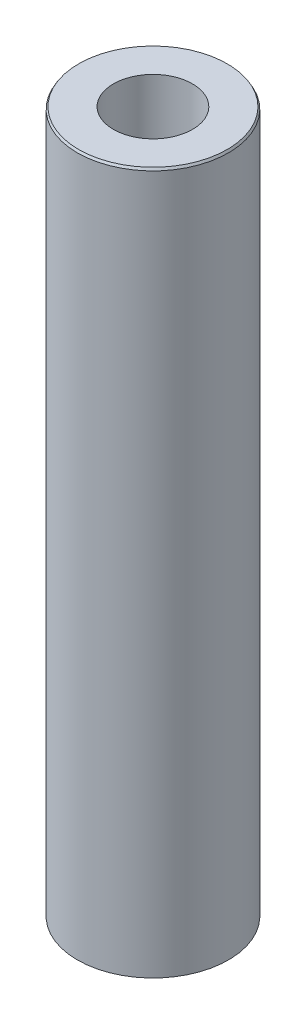
ISO-10303-21;
HEADER;
FILE_DESCRIPTION(('STEP AP214'),'2;1');
FILE_NAME('part.step','',(''),(''),'','','');
FILE_SCHEMA(('AUTOMOTIVE_DESIGN { 1 0 10303 214 1 1 1 1 }'));
ENDSEC;
DATA;
#1=APPLICATION_CONTEXT('core data for automotive mechanical design processes');
#2=APPLICATION_PROTOCOL_DEFINITION('international standard','automotive_design',2000,#1);
#3=PRODUCT_CONTEXT('',#1,'mechanical');
#4=PRODUCT('Part','Part','',(#3));
#5=PRODUCT_RELATED_PRODUCT_CATEGORY('part','',(#4));
#6=PRODUCT_DEFINITION_FORMATION('','',#4);
#7=PRODUCT_DEFINITION_CONTEXT('part definition',#1,'design');
#8=PRODUCT_DEFINITION('design','',#6,#7);
#9=PRODUCT_DEFINITION_SHAPE('','',#8);
#10=(LENGTH_UNIT() NAMED_UNIT(*) SI_UNIT(.MILLI.,.METRE.));
#11=(NAMED_UNIT(*) PLANE_ANGLE_UNIT() SI_UNIT($,.RADIAN.));
#12=(NAMED_UNIT(*) SI_UNIT($,.STERADIAN.) SOLID_ANGLE_UNIT());
#13=UNCERTAINTY_MEASURE_WITH_UNIT(LENGTH_MEASURE(1.E-05),#10,'distance_accuracy_value','');
#14=(GEOMETRIC_REPRESENTATION_CONTEXT(3) GLOBAL_UNCERTAINTY_ASSIGNED_CONTEXT((#13)) GLOBAL_UNIT_ASSIGNED_CONTEXT((#10,
#11,#12)) REPRESENTATION_CONTEXT('',''));
#15=CARTESIAN_POINT('',(0.,0.,0.));
#16=DIRECTION('',(0.,0.,1.));
#17=DIRECTION('',(1.,0.,0.));
#18=AXIS2_PLACEMENT_3D('',#15,#16,#17);
#19=CARTESIAN_POINT('',(0.,116.207026086322,0.));
#20=DIRECTION('',(0.,-1.,0.));
#21=DIRECTION('',(0.,0.,-1.));
#22=AXIS2_PLACEMENT_3D('',#19,#20,#21);
#23=CYLINDRICAL_SURFACE('',#22,12.5);
#24=CARTESIAN_POINT('',(0.,115.835924276657,0.));
#25=DIRECTION('',(0.,1.,0.));
#26=DIRECTION('',(0.,0.,1.));
#27=AXIS2_PLACEMENT_3D('',#24,#25,#26);
#28=CIRCLE('',#27,12.5);
#29=CARTESIAN_POINT('',(0.,115.835924276657,12.5));
#30=VERTEX_POINT('',#29);
#31=EDGE_CURVE('E50',#30,#30,#28,.F.);
#32=ORIENTED_EDGE('',*,*,#31,.T.);
#33=EDGE_LOOP('',(#32));
#34=FACE_BOUND('',#33,.T.);
#35=CARTESIAN_POINT('',(0.,0.214255729706833,0.));
#36=DIRECTION('',(0.,1.,0.));
#37=DIRECTION('',(0.,0.,1.));
#38=AXIS2_PLACEMENT_3D('',#35,#36,#37);
#39=CIRCLE('',#38,12.5);
#40=CARTESIAN_POINT('',(0.,0.214255729706833,12.5));
#41=VERTEX_POINT('',#40);
#42=EDGE_CURVE('E51',#41,#41,#39,.T.);
#43=ORIENTED_EDGE('',*,*,#42,.T.);
#44=EDGE_LOOP('',(#43));
#45=FACE_BOUND('',#44,.T.);
#46=ADVANCED_FACE('F39',(#34,#45),#23,.T.);
#47=CARTESIAN_POINT('',(0.,116.207026086322,0.));
#48=DIRECTION('',(0.,1.,0.));
#49=DIRECTION('',(0.,0.,1.));
#50=AXIS2_PLACEMENT_3D('',#47,#48,#49);
#51=PLANE('',#50);
#52=CARTESIAN_POINT('',(0.,116.207026086322,0.));
#53=DIRECTION('',(0.,1.,0.));
#54=DIRECTION('',(0.,0.,1.));
#55=AXIS2_PLACEMENT_3D('',#52,#53,#54);
#56=CIRCLE('',#55,12.2857442702932);
#57=CARTESIAN_POINT('',(0.,116.207026086322,12.2857442702932));
#58=VERTEX_POINT('',#57);
#59=EDGE_CURVE('E54',#58,#58,#56,.T.);
#60=ORIENTED_EDGE('',*,*,#59,.T.);
#61=EDGE_LOOP('',(#60));
#62=FACE_BOUND('',#61,.T.);
#63=CARTESIAN_POINT('',(0.,116.207026086322,0.));
#64=DIRECTION('',(0.,1.,0.));
#65=DIRECTION('',(0.,0.,1.));
#66=AXIS2_PLACEMENT_3D('',#63,#64,#65);
#67=CIRCLE('',#66,6.53770841501012);
#68=CARTESIAN_POINT('',(0.,116.207026086322,6.53770841501012));
#69=VERTEX_POINT('',#68);
#70=EDGE_CURVE('E58',#69,#69,#67,.T.);
#71=ORIENTED_EDGE('',*,*,#70,.F.);
#72=EDGE_LOOP('',(#71));
#73=FACE_BOUND('',#72,.T.);
#74=ADVANCED_FACE('F69',(#62,#73),#51,.T.);
#75=CARTESIAN_POINT('',(0.,0.,0.));
#76=DIRECTION('',(0.,1.,0.));
#77=DIRECTION('',(0.,0.,1.));
#78=AXIS2_PLACEMENT_3D('',#75,#76,#77);
#79=PLANE('',#78);
#80=CARTESIAN_POINT('',(0.,0.,0.));
#81=DIRECTION('',(0.,1.,0.));
#82=DIRECTION('',(0.,0.,1.));
#83=AXIS2_PLACEMENT_3D('',#80,#81,#82);
#84=CIRCLE('',#83,12.128898190335);
#85=CARTESIAN_POINT('',(0.,0.,12.128898190335));
#86=VERTEX_POINT('',#85);
#87=EDGE_CURVE('E10',#86,#86,#84,.F.);
#88=ORIENTED_EDGE('',*,*,#87,.T.);
#89=EDGE_LOOP('',(#88));
#90=FACE_BOUND('',#89,.T.);
#91=CARTESIAN_POINT('',(0.,0.,0.));
#92=DIRECTION('',(0.,1.,0.));
#93=DIRECTION('',(0.,0.,1.));
#94=AXIS2_PLACEMENT_3D('',#91,#92,#93);
#95=CIRCLE('',#94,6.53770841501012);
#96=CARTESIAN_POINT('',(0.,0.,6.53770841501012));
#97=VERTEX_POINT('',#96);
#98=EDGE_CURVE('E63',#97,#97,#95,.T.);
#99=ORIENTED_EDGE('',*,*,#98,.T.);
#100=EDGE_LOOP('',(#99));
#101=FACE_BOUND('',#100,.T.);
#102=ADVANCED_FACE('F75',(#90,#101),#79,.F.);
#103=CARTESIAN_POINT('',(0.,116.207026086322,0.));
#104=DIRECTION('',(0.,-1.,0.));
#105=DIRECTION('',(0.,0.,-1.));
#106=AXIS2_PLACEMENT_3D('',#103,#104,#105);
#107=CYLINDRICAL_SURFACE('',#106,6.53770841501012);
#108=ORIENTED_EDGE('',*,*,#70,.T.);
#109=EDGE_LOOP('',(#108));
#110=FACE_BOUND('',#109,.T.);
#111=ORIENTED_EDGE('',*,*,#98,.F.);
#112=EDGE_LOOP('',(#111));
#113=FACE_BOUND('',#112,.T.);
#114=ADVANCED_FACE('F70',(#110,#113),#107,.F.);
#115=CARTESIAN_POINT('',(0.,116.207026086322,0.));
#116=DIRECTION('',(0.,-1.,0.));
#117=DIRECTION('',(0.,0.,-1.));
#118=AXIS2_PLACEMENT_3D('',#115,#116,#117);
#119=CONICAL_SURFACE('',#118,12.2857442702932,0.523598775598267);
#120=ORIENTED_EDGE('',*,*,#31,.F.);
#121=EDGE_LOOP('',(#120));
#122=FACE_BOUND('',#121,.T.);
#123=ORIENTED_EDGE('',*,*,#59,.F.);
#124=EDGE_LOOP('',(#123));
#125=FACE_BOUND('',#124,.T.);
#126=ADVANCED_FACE('F81',(#122,#125),#119,.T.);
#127=CARTESIAN_POINT('',(0.,0.214255729706833,0.));
#128=DIRECTION('',(0.,1.,0.));
#129=DIRECTION('',(0.,0.,1.));
#130=AXIS2_PLACEMENT_3D('',#127,#128,#129);
#131=CONICAL_SURFACE('',#130,12.5,1.04719755119659);
#132=ORIENTED_EDGE('',*,*,#87,.F.);
#133=EDGE_LOOP('',(#132));
#134=FACE_BOUND('',#133,.T.);
#135=ORIENTED_EDGE('',*,*,#42,.F.);
#136=EDGE_LOOP('',(#135));
#137=FACE_BOUND('',#136,.T.);
#138=ADVANCED_FACE('F45',(#134,#137),#131,.T.);
#139=CLOSED_SHELL('',(#46,#74,#102,#114,#126,#138));
#140=MANIFOLD_SOLID_BREP('B2',#139);
#141=ADVANCED_BREP_SHAPE_REPRESENTATION('',(#18,#140),#14);
#142=SHAPE_DEFINITION_REPRESENTATION(#9,#141);
ENDSEC;
END-ISO-10303-21;
